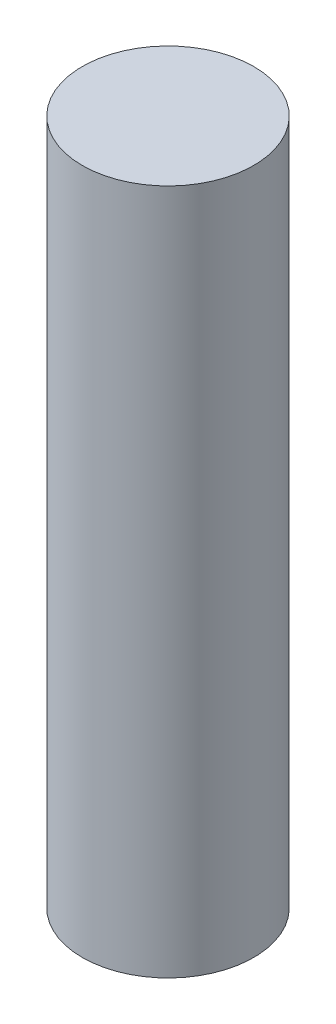
ISO-10303-21;
HEADER;
FILE_DESCRIPTION(('STEP AP214'),'2;1');
FILE_NAME('part.step','',(''),(''),'','','');
FILE_SCHEMA(('AUTOMOTIVE_DESIGN { 1 0 10303 214 1 1 1 1 }'));
ENDSEC;
DATA;
#1=APPLICATION_CONTEXT('core data for automotive mechanical design processes');
#2=APPLICATION_PROTOCOL_DEFINITION('international standard','automotive_design',2000,#1);
#3=PRODUCT_CONTEXT('',#1,'mechanical');
#4=PRODUCT('Part','Part','',(#3));
#5=PRODUCT_RELATED_PRODUCT_CATEGORY('part','',(#4));
#6=PRODUCT_DEFINITION_FORMATION('','',#4);
#7=PRODUCT_DEFINITION_CONTEXT('part definition',#1,'design');
#8=PRODUCT_DEFINITION('design','',#6,#7);
#9=PRODUCT_DEFINITION_SHAPE('','',#8);
#10=(LENGTH_UNIT() NAMED_UNIT(*) SI_UNIT(.MILLI.,.METRE.));
#11=(NAMED_UNIT(*) PLANE_ANGLE_UNIT() SI_UNIT($,.RADIAN.));
#12=(NAMED_UNIT(*) SI_UNIT($,.STERADIAN.) SOLID_ANGLE_UNIT());
#13=UNCERTAINTY_MEASURE_WITH_UNIT(LENGTH_MEASURE(1.E-05),#10,'distance_accuracy_value','');
#14=(GEOMETRIC_REPRESENTATION_CONTEXT(3) GLOBAL_UNCERTAINTY_ASSIGNED_CONTEXT((#13)) GLOBAL_UNIT_ASSIGNED_CONTEXT((#10,
#11,#12)) REPRESENTATION_CONTEXT('',''));
#15=CARTESIAN_POINT('',(0.,0.,0.));
#16=DIRECTION('',(0.,0.,1.));
#17=DIRECTION('',(1.,0.,0.));
#18=AXIS2_PLACEMENT_3D('',#15,#16,#17);
#19=CARTESIAN_POINT('',(0.,50.8,0.));
#20=DIRECTION('',(0.,-1.,0.));
#21=DIRECTION('',(0.,0.,-1.));
#22=AXIS2_PLACEMENT_3D('',#19,#20,#21);
#23=CYLINDRICAL_SURFACE('',#22,6.35);
#24=CARTESIAN_POINT('',(0.,50.8,0.));
#25=DIRECTION('',(0.,1.,0.));
#26=DIRECTION('',(0.,0.,1.));
#27=AXIS2_PLACEMENT_3D('',#24,#25,#26);
#28=CIRCLE('',#27,6.35);
#29=CARTESIAN_POINT('',(0.,50.8,6.35));
#30=VERTEX_POINT('',#29);
#31=EDGE_CURVE('E10',#30,#30,#28,.T.);
#32=ORIENTED_EDGE('',*,*,#31,.F.);
#33=EDGE_LOOP('',(#32));
#34=FACE_BOUND('',#33,.T.);
#35=CARTESIAN_POINT('',(0.,0.,0.));
#36=DIRECTION('',(0.,1.,0.));
#37=DIRECTION('',(0.,0.,1.));
#38=AXIS2_PLACEMENT_3D('',#35,#36,#37);
#39=CIRCLE('',#38,6.35);
#40=CARTESIAN_POINT('',(0.,0.,6.35));
#41=VERTEX_POINT('',#40);
#42=EDGE_CURVE('E34',#41,#41,#39,.T.);
#43=ORIENTED_EDGE('',*,*,#42,.T.);
#44=EDGE_LOOP('',(#43));
#45=FACE_BOUND('',#44,.T.);
#46=ADVANCED_FACE('F31',(#34,#45),#23,.T.);
#47=CARTESIAN_POINT('',(0.,50.8,0.));
#48=DIRECTION('',(0.,1.,0.));
#49=DIRECTION('',(0.,0.,1.));
#50=AXIS2_PLACEMENT_3D('',#47,#48,#49);
#51=PLANE('',#50);
#52=ORIENTED_EDGE('',*,*,#31,.T.);
#53=EDGE_LOOP('',(#52));
#54=FACE_BOUND('',#53,.T.);
#55=ADVANCED_FACE('F46',(#54),#51,.T.);
#56=CARTESIAN_POINT('',(0.,0.,0.));
#57=DIRECTION('',(0.,1.,0.));
#58=DIRECTION('',(0.,0.,1.));
#59=AXIS2_PLACEMENT_3D('',#56,#57,#58);
#60=PLANE('',#59);
#61=ORIENTED_EDGE('',*,*,#42,.F.);
#62=EDGE_LOOP('',(#61));
#63=FACE_BOUND('',#62,.T.);
#64=ADVANCED_FACE('F44',(#63),#60,.F.);
#65=CLOSED_SHELL('',(#46,#55,#64));
#66=MANIFOLD_SOLID_BREP('B2',#65);
#67=ADVANCED_BREP_SHAPE_REPRESENTATION('',(#18,#66),#14);
#68=SHAPE_DEFINITION_REPRESENTATION(#9,#67);
ENDSEC;
END-ISO-10303-21;
